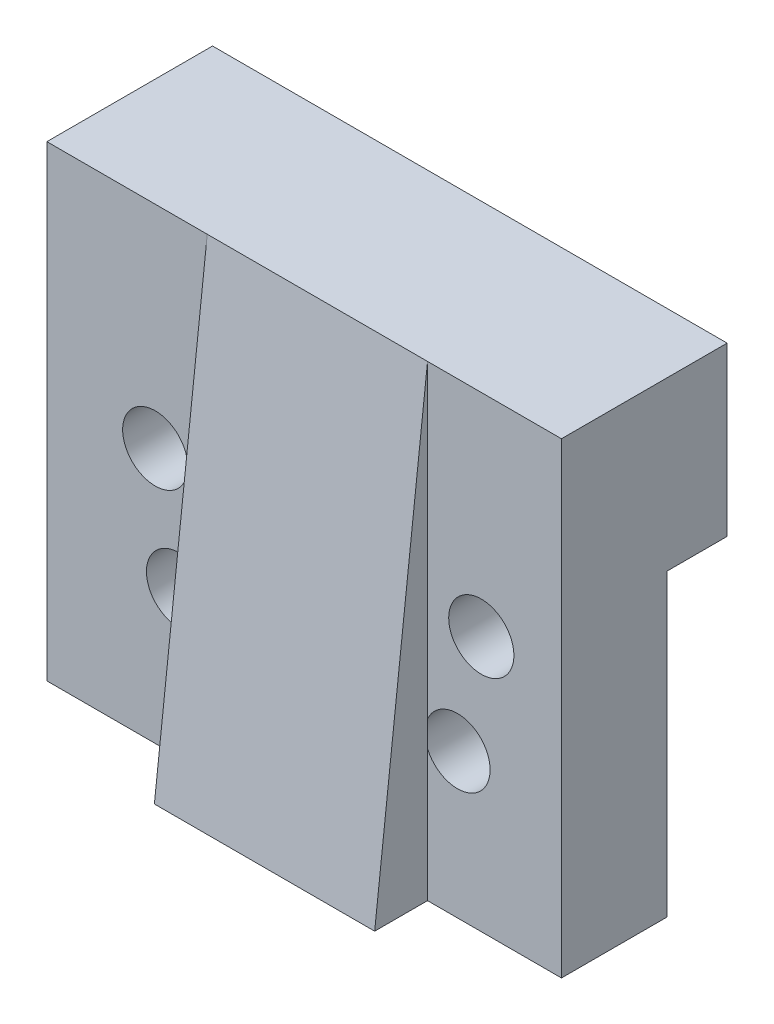
ISO-10303-21;
HEADER;
FILE_DESCRIPTION(('STEP AP214'),'2;1');
FILE_NAME('part.step','',(''),(''),'','','');
FILE_SCHEMA(('AUTOMOTIVE_DESIGN { 1 0 10303 214 1 1 1 1 }'));
ENDSEC;
DATA;
#1=APPLICATION_CONTEXT('core data for automotive mechanical design processes');
#2=APPLICATION_PROTOCOL_DEFINITION('international standard','automotive_design',2000,#1);
#3=PRODUCT_CONTEXT('',#1,'mechanical');
#4=PRODUCT('Part','Part','',(#3));
#5=PRODUCT_RELATED_PRODUCT_CATEGORY('part','',(#4));
#6=PRODUCT_DEFINITION_FORMATION('','',#4);
#7=PRODUCT_DEFINITION_CONTEXT('part definition',#1,'design');
#8=PRODUCT_DEFINITION('design','',#6,#7);
#9=PRODUCT_DEFINITION_SHAPE('','',#8);
#10=(LENGTH_UNIT() NAMED_UNIT(*) SI_UNIT(.MILLI.,.METRE.));
#11=(NAMED_UNIT(*) PLANE_ANGLE_UNIT() SI_UNIT($,.RADIAN.));
#12=(NAMED_UNIT(*) SI_UNIT($,.STERADIAN.) SOLID_ANGLE_UNIT());
#13=UNCERTAINTY_MEASURE_WITH_UNIT(LENGTH_MEASURE(1.E-05),#10,'distance_accuracy_value','');
#14=(GEOMETRIC_REPRESENTATION_CONTEXT(3) GLOBAL_UNCERTAINTY_ASSIGNED_CONTEXT((#13)) GLOBAL_UNIT_ASSIGNED_CONTEXT((#10,
#11,#12)) REPRESENTATION_CONTEXT('',''));
#15=CARTESIAN_POINT('',(0.,0.,0.));
#16=DIRECTION('',(0.,0.,1.));
#17=DIRECTION('',(1.,0.,0.));
#18=AXIS2_PLACEMENT_3D('',#15,#16,#17);
#19=CARTESIAN_POINT('',(0.,0.,6.));
#20=DIRECTION('',(0.,0.,1.));
#21=DIRECTION('',(1.,0.,0.));
#22=AXIS2_PLACEMENT_3D('',#19,#20,#21);
#23=PLANE('',#22);
#24=CARTESIAN_POINT('',(-10.0801094247372,-3.25,6.));
#25=DIRECTION('',(0.,0.,1.));
#26=DIRECTION('',(1.,0.,0.));
#27=AXIS2_PLACEMENT_3D('',#24,#25,#26);
#28=CIRCLE('',#27,1.85);
#29=CARTESIAN_POINT('',(-8.23010942473721,-3.25,6.));
#30=VERTEX_POINT('',#29);
#31=EDGE_CURVE('E277',#30,#30,#28,.T.);
#32=ORIENTED_EDGE('',*,*,#31,.F.);
#33=EDGE_LOOP('',(#32));
#34=FACE_BOUND('',#33,.T.);
#35=DIRECTION('',(1.,0.,0.));
#36=VECTOR('',#35,1.);
#37=CARTESIAN_POINT('',(-16.2301094247372,-17.75,6.));
#38=LINE('',#37,#36);
#39=CARTESIAN_POINT('',(-16.2301094247372,-17.75,6.));
#40=VERTEX_POINT('',#39);
#41=CARTESIAN_POINT('',(-7.13010942473722,-17.75,6.));
#42=VERTEX_POINT('',#41);
#43=EDGE_CURVE('E169',#40,#42,#38,.T.);
#44=ORIENTED_EDGE('',*,*,#43,.T.);
#45=DIRECTION('',(0.,1.,0.));
#46=VECTOR('',#45,1.);
#47=CARTESIAN_POINT('',(-7.13010942473722,-17.75,6.));
#48=LINE('',#47,#46);
#49=CARTESIAN_POINT('',(-7.13010942473722,-10.4787087810503,6.));
#50=VERTEX_POINT('',#49);
#51=EDGE_CURVE('E153',#42,#50,#48,.T.);
#52=ORIENTED_EDGE('',*,*,#51,.T.);
#53=CARTESIAN_POINT('',(-8.73010942473722,-9.55,6.));
#54=DIRECTION('',(0.,0.,1.));
#55=DIRECTION('',(1.,0.,0.));
#56=AXIS2_PLACEMENT_3D('',#53,#54,#55);
#57=CIRCLE('',#56,1.85);
#58=CARTESIAN_POINT('',(-7.13010942473722,-8.62129121894966,6.));
#59=VERTEX_POINT('',#58);
#60=EDGE_CURVE('E272',#59,#50,#57,.T.);
#61=ORIENTED_EDGE('',*,*,#60,.F.);
#62=CARTESIAN_POINT('',(-7.13010942473722,8.75,6.));
#63=VERTEX_POINT('',#62);
#64=EDGE_CURVE('E42',#59,#63,#48,.T.);
#65=ORIENTED_EDGE('',*,*,#64,.T.);
#66=DIRECTION('',(-1.,0.,0.));
#67=VECTOR('',#66,1.);
#68=CARTESIAN_POINT('',(12.9698905752628,8.75,6.));
#69=LINE('',#68,#67);
#70=CARTESIAN_POINT('',(-16.2301094247372,8.75,6.));
#71=VERTEX_POINT('',#70);
#72=EDGE_CURVE('E186',#63,#71,#69,.T.);
#73=ORIENTED_EDGE('',*,*,#72,.T.);
#74=DIRECTION('',(0.,-1.,0.));
#75=VECTOR('',#74,1.);
#76=CARTESIAN_POINT('',(-16.2301094247372,8.75,6.));
#77=LINE('',#76,#75);
#78=EDGE_CURVE('E176',#71,#40,#77,.T.);
#79=ORIENTED_EDGE('',*,*,#78,.T.);
#80=EDGE_LOOP('',(#44,#52,#61,#65,#73,#79));
#81=FACE_BOUND('',#80,.T.);
#82=ADVANCED_FACE('F33',(#34,#81),#23,.T.);
#83=CARTESIAN_POINT('',(0.,0.,0.));
#84=DIRECTION('',(0.,0.,1.));
#85=DIRECTION('',(1.,0.,0.));
#86=AXIS2_PLACEMENT_3D('',#83,#84,#85);
#87=PLANE('',#86);
#88=CARTESIAN_POINT('',(7.06989057526278,-9.55,0.));
#89=DIRECTION('',(0.,0.,1.));
#90=DIRECTION('',(-1.,0.,0.));
#91=AXIS2_PLACEMENT_3D('',#88,#89,#90);
#92=CIRCLE('',#91,1.);
#93=CARTESIAN_POINT('',(6.06989057526278,-9.55,0.));
#94=VERTEX_POINT('',#93);
#95=EDGE_CURVE('E181',#94,#94,#92,.T.);
#96=ORIENTED_EDGE('',*,*,#95,.T.);
#97=EDGE_LOOP('',(#96));
#98=FACE_BOUND('',#97,.T.);
#99=CARTESIAN_POINT('',(8.41989057526278,-3.25,0.));
#100=DIRECTION('',(0.,0.,1.));
#101=DIRECTION('',(-1.,0.,0.));
#102=AXIS2_PLACEMENT_3D('',#99,#100,#101);
#103=CIRCLE('',#102,1.);
#104=CARTESIAN_POINT('',(7.41989057526278,-3.25,0.));
#105=VERTEX_POINT('',#104);
#106=EDGE_CURVE('E203',#105,#105,#103,.T.);
#107=ORIENTED_EDGE('',*,*,#106,.T.);
#108=EDGE_LOOP('',(#107));
#109=FACE_BOUND('',#108,.T.);
#110=CARTESIAN_POINT('',(-10.0801094247372,-3.25,0.));
#111=DIRECTION('',(0.,0.,1.));
#112=DIRECTION('',(1.,0.,0.));
#113=AXIS2_PLACEMENT_3D('',#110,#111,#112);
#114=CIRCLE('',#113,1.);
#115=CARTESIAN_POINT('',(-9.08010942473722,-3.25,0.));
#116=VERTEX_POINT('',#115);
#117=EDGE_CURVE('E209',#116,#116,#114,.T.);
#118=ORIENTED_EDGE('',*,*,#117,.T.);
#119=EDGE_LOOP('',(#118));
#120=FACE_BOUND('',#119,.T.);
#121=CARTESIAN_POINT('',(-8.73010942473722,-9.55,0.));
#122=DIRECTION('',(0.,0.,1.));
#123=DIRECTION('',(1.,0.,0.));
#124=AXIS2_PLACEMENT_3D('',#121,#122,#123);
#125=CIRCLE('',#124,1.);
#126=CARTESIAN_POINT('',(-7.73010942473722,-9.55,0.));
#127=VERTEX_POINT('',#126);
#128=EDGE_CURVE('E197',#127,#127,#125,.T.);
#129=ORIENTED_EDGE('',*,*,#128,.T.);
#130=EDGE_LOOP('',(#129));
#131=FACE_BOUND('',#130,.T.);
#132=DIRECTION('',(-1.,0.,0.));
#133=VECTOR('',#132,1.);
#134=CARTESIAN_POINT('',(12.9698905752628,-0.749999999999994,0.));
#135=LINE('',#134,#133);
#136=CARTESIAN_POINT('',(12.9698905752628,-0.749999999999994,0.));
#137=VERTEX_POINT('',#136);
#138=CARTESIAN_POINT('',(5.36989057526278,-0.749999999999994,0.));
#139=VERTEX_POINT('',#138);
#140=EDGE_CURVE('E227',#137,#139,#135,.T.);
#141=ORIENTED_EDGE('',*,*,#140,.F.);
#142=DIRECTION('',(0.,1.,0.));
#143=VECTOR('',#142,1.);
#144=CARTESIAN_POINT('',(12.9698905752628,8.75,0.));
#145=LINE('',#144,#143);
#146=CARTESIAN_POINT('',(12.9698905752628,-17.75,0.));
#147=VERTEX_POINT('',#146);
#148=EDGE_CURVE('E225',#147,#137,#145,.T.);
#149=ORIENTED_EDGE('',*,*,#148,.F.);
#150=DIRECTION('',(1.,0.,0.));
#151=VECTOR('',#150,1.);
#152=CARTESIAN_POINT('',(-16.2301094247372,-17.75,0.));
#153=LINE('',#152,#151);
#154=CARTESIAN_POINT('',(-16.2301094247372,-17.75,0.));
#155=VERTEX_POINT('',#154);
#156=EDGE_CURVE('E220',#155,#147,#153,.T.);
#157=ORIENTED_EDGE('',*,*,#156,.F.);
#158=DIRECTION('',(0.,-1.,0.));
#159=VECTOR('',#158,1.);
#160=CARTESIAN_POINT('',(-16.2301094247372,-7.,0.));
#161=LINE('',#160,#159);
#162=CARTESIAN_POINT('',(-16.2301094247372,-0.749999999999993,0.));
#163=VERTEX_POINT('',#162);
#164=EDGE_CURVE('E215',#163,#155,#161,.T.);
#165=ORIENTED_EDGE('',*,*,#164,.F.);
#166=DIRECTION('',(-1.,0.,0.));
#167=VECTOR('',#166,1.);
#168=CARTESIAN_POINT('',(-7.03010942473722,-0.749999999999994,0.));
#169=LINE('',#168,#167);
#170=CARTESIAN_POINT('',(-7.03010942473722,-0.749999999999994,0.));
#171=VERTEX_POINT('',#170);
#172=EDGE_CURVE('E58',#171,#163,#169,.T.);
#173=ORIENTED_EDGE('',*,*,#172,.F.);
#174=DIRECTION('',(0.,1.,0.));
#175=VECTOR('',#174,1.);
#176=CARTESIAN_POINT('',(-7.03010942473722,-5.5,0.));
#177=LINE('',#176,#175);
#178=CARTESIAN_POINT('',(-7.03010942473722,-5.5,0.));
#179=VERTEX_POINT('',#178);
#180=EDGE_CURVE('E243',#179,#171,#177,.T.);
#181=ORIENTED_EDGE('',*,*,#180,.F.);
#182=DIRECTION('',(-0.707106781186547,0.707106781186548,0.));
#183=VECTOR('',#182,1.);
#184=CARTESIAN_POINT('',(-5.53010942473722,-7.,0.));
#185=LINE('',#184,#183);
#186=CARTESIAN_POINT('',(-5.53010942473722,-7.,0.));
#187=VERTEX_POINT('',#186);
#188=EDGE_CURVE('E380',#187,#179,#185,.T.);
#189=ORIENTED_EDGE('',*,*,#188,.F.);
#190=DIRECTION('',(-1.,0.,0.));
#191=VECTOR('',#190,1.);
#192=CARTESIAN_POINT('',(3.86989057526278,-7.,0.));
#193=LINE('',#192,#191);
#194=CARTESIAN_POINT('',(3.86989057526278,-7.,0.));
#195=VERTEX_POINT('',#194);
#196=EDGE_CURVE('E378',#195,#187,#193,.T.);
#197=ORIENTED_EDGE('',*,*,#196,.F.);
#198=DIRECTION('',(-0.707106781186547,-0.707106781186548,0.));
#199=VECTOR('',#198,1.);
#200=CARTESIAN_POINT('',(3.86989057526278,-7.,0.));
#201=LINE('',#200,#199);
#202=CARTESIAN_POINT('',(5.36989057526278,-5.5,0.));
#203=VERTEX_POINT('',#202);
#204=EDGE_CURVE('E375',#203,#195,#201,.T.);
#205=ORIENTED_EDGE('',*,*,#204,.F.);
#206=DIRECTION('',(0.,-1.,0.));
#207=VECTOR('',#206,1.);
#208=CARTESIAN_POINT('',(5.36989057526278,-0.749999999999994,0.));
#209=LINE('',#208,#207);
#210=EDGE_CURVE('E230',#139,#203,#209,.T.);
#211=ORIENTED_EDGE('',*,*,#210,.F.);
#212=EDGE_LOOP('',(#141,#149,#157,#165,#173,#181,#189,#197,#205,#211));
#213=FACE_BOUND('',#212,.T.);
#214=ADVANCED_FACE('F410',(#98,#109,#120,#131,#213),#87,.F.);
#215=CARTESIAN_POINT('',(0.,0.,1.7));
#216=DIRECTION('',(0.,0.,1.));
#217=DIRECTION('',(1.,0.,0.));
#218=AXIS2_PLACEMENT_3D('',#215,#216,#217);
#219=PLANE('',#218);
#220=CARTESIAN_POINT('',(-10.0801094247372,-3.25,1.7));
#221=DIRECTION('',(0.,0.,1.));
#222=DIRECTION('',(1.,0.,0.));
#223=AXIS2_PLACEMENT_3D('',#220,#221,#222);
#224=CIRCLE('',#223,1.85);
#225=CARTESIAN_POINT('',(-8.23010942473721,-3.25,1.7));
#226=VERTEX_POINT('',#225);
#227=EDGE_CURVE('E319',#226,#226,#224,.F.);
#228=ORIENTED_EDGE('',*,*,#227,.F.);
#229=EDGE_LOOP('',(#228));
#230=FACE_BOUND('',#229,.T.);
#231=CARTESIAN_POINT('',(-10.0801094247372,-3.25,1.7));
#232=DIRECTION('',(0.,0.,1.));
#233=DIRECTION('',(1.,0.,0.));
#234=AXIS2_PLACEMENT_3D('',#231,#232,#233);
#235=CIRCLE('',#234,1.);
#236=CARTESIAN_POINT('',(-9.08010942473722,-3.25,1.7));
#237=VERTEX_POINT('',#236);
#238=EDGE_CURVE('E212',#237,#237,#235,.T.);
#239=ORIENTED_EDGE('',*,*,#238,.F.);
#240=EDGE_LOOP('',(#239));
#241=FACE_BOUND('',#240,.T.);
#242=ADVANCED_FACE('F417',(#230,#241),#219,.T.);
#243=CARTESIAN_POINT('',(8.41989057526278,-3.25,1.7));
#244=DIRECTION('',(0.,0.,1.));
#245=DIRECTION('',(1.,0.,0.));
#246=AXIS2_PLACEMENT_3D('',#243,#244,#245);
#247=CIRCLE('',#246,1.85);
#248=CARTESIAN_POINT('',(10.2698905752628,-3.25,1.7));
#249=VERTEX_POINT('',#248);
#250=EDGE_CURVE('E317',#249,#249,#247,.F.);
#251=ORIENTED_EDGE('',*,*,#250,.F.);
#252=EDGE_LOOP('',(#251));
#253=FACE_BOUND('',#252,.T.);
#254=CARTESIAN_POINT('',(8.41989057526278,-3.25,1.7));
#255=DIRECTION('',(0.,0.,1.));
#256=DIRECTION('',(-1.,0.,0.));
#257=AXIS2_PLACEMENT_3D('',#254,#255,#256);
#258=CIRCLE('',#257,1.);
#259=CARTESIAN_POINT('',(7.41989057526278,-3.25,1.7));
#260=VERTEX_POINT('',#259);
#261=EDGE_CURVE('E206',#260,#260,#258,.T.);
#262=ORIENTED_EDGE('',*,*,#261,.F.);
#263=EDGE_LOOP('',(#262));
#264=FACE_BOUND('',#263,.T.);
#265=ADVANCED_FACE('F445',(#253,#264),#219,.T.);
#266=CARTESIAN_POINT('',(-8.73010942473722,-9.55,1.7));
#267=DIRECTION('',(0.,0.,1.));
#268=DIRECTION('',(1.,0.,0.));
#269=AXIS2_PLACEMENT_3D('',#266,#267,#268);
#270=CIRCLE('',#269,1.85);
#271=CARTESIAN_POINT('',(-6.88010942473722,-9.55,1.7));
#272=VERTEX_POINT('',#271);
#273=EDGE_CURVE('E314',#272,#272,#270,.F.);
#274=ORIENTED_EDGE('',*,*,#273,.F.);
#275=EDGE_LOOP('',(#274));
#276=FACE_BOUND('',#275,.T.);
#277=CARTESIAN_POINT('',(-8.73010942473722,-9.55,1.7));
#278=DIRECTION('',(0.,0.,1.));
#279=DIRECTION('',(1.,0.,0.));
#280=AXIS2_PLACEMENT_3D('',#277,#278,#279);
#281=CIRCLE('',#280,1.);
#282=CARTESIAN_POINT('',(-7.73010942473722,-9.55,1.7));
#283=VERTEX_POINT('',#282);
#284=EDGE_CURVE('E200',#283,#283,#281,.T.);
#285=ORIENTED_EDGE('',*,*,#284,.F.);
#286=EDGE_LOOP('',(#285));
#287=FACE_BOUND('',#286,.T.);
#288=ADVANCED_FACE('F448',(#276,#287),#219,.T.);
#289=CARTESIAN_POINT('',(7.06989057526278,-9.55,1.7));
#290=DIRECTION('',(0.,0.,1.));
#291=DIRECTION('',(1.,0.,0.));
#292=AXIS2_PLACEMENT_3D('',#289,#290,#291);
#293=CIRCLE('',#292,1.85);
#294=CARTESIAN_POINT('',(8.91989057526279,-9.55,1.7));
#295=VERTEX_POINT('',#294);
#296=EDGE_CURVE('E299',#295,#295,#293,.F.);
#297=ORIENTED_EDGE('',*,*,#296,.F.);
#298=EDGE_LOOP('',(#297));
#299=FACE_BOUND('',#298,.T.);
#300=CARTESIAN_POINT('',(7.06989057526278,-9.55,1.7));
#301=DIRECTION('',(0.,0.,1.));
#302=DIRECTION('',(-1.,0.,0.));
#303=AXIS2_PLACEMENT_3D('',#300,#301,#302);
#304=CIRCLE('',#303,1.);
#305=CARTESIAN_POINT('',(6.06989057526278,-9.55,1.7));
#306=VERTEX_POINT('',#305);
#307=EDGE_CURVE('E194',#306,#306,#304,.T.);
#308=ORIENTED_EDGE('',*,*,#307,.F.);
#309=EDGE_LOOP('',(#308));
#310=FACE_BOUND('',#309,.T.);
#311=ADVANCED_FACE('F504',(#299,#310),#219,.T.);
#312=CARTESIAN_POINT('',(12.9698905752628,8.75,1.7));
#313=DIRECTION('',(0.,-1.,0.));
#314=DIRECTION('',(1.,0.,0.));
#315=AXIS2_PLACEMENT_3D('',#312,#313,#314);
#316=PLANE('',#315);
#317=DIRECTION('',(0.,0.,-1.));
#318=VECTOR('',#317,1.);
#319=CARTESIAN_POINT('',(12.9698905752628,8.75,1.7));
#320=LINE('',#319,#318);
#321=CARTESIAN_POINT('',(12.9698905752628,8.75,6.));
#322=VERTEX_POINT('',#321);
#323=CARTESIAN_POINT('',(12.9698905752628,8.75,-3.4));
#324=VERTEX_POINT('',#323);
#325=EDGE_CURVE('E308',#322,#324,#320,.T.);
#326=ORIENTED_EDGE('',*,*,#325,.T.);
#327=DIRECTION('',(1.,0.,0.));
#328=VECTOR('',#327,1.);
#329=CARTESIAN_POINT('',(-16.2301094247372,8.75,-3.4));
#330=LINE('',#329,#328);
#331=CARTESIAN_POINT('',(-16.2301094247372,8.75,-3.4));
#332=VERTEX_POINT('',#331);
#333=EDGE_CURVE('E295',#332,#324,#330,.T.);
#334=ORIENTED_EDGE('',*,*,#333,.F.);
#335=DIRECTION('',(0.,0.,-1.));
#336=VECTOR('',#335,1.);
#337=CARTESIAN_POINT('',(-16.2301094247372,8.75,1.7));
#338=LINE('',#337,#336);
#339=EDGE_CURVE('E293',#71,#332,#338,.T.);
#340=ORIENTED_EDGE('',*,*,#339,.F.);
#341=ORIENTED_EDGE('',*,*,#72,.F.);
#342=DIRECTION('',(1.,0.,0.));
#343=VECTOR('',#342,1.);
#344=CARTESIAN_POINT('',(-7.13010942473722,8.75,6.));
#345=LINE('',#344,#343);
#346=CARTESIAN_POINT('',(5.36989057526278,8.75,6.));
#347=VERTEX_POINT('',#346);
#348=EDGE_CURVE('E351',#63,#347,#345,.T.);
#349=ORIENTED_EDGE('',*,*,#348,.T.);
#350=EDGE_CURVE('E281',#322,#347,#69,.T.);
#351=ORIENTED_EDGE('',*,*,#350,.F.);
#352=EDGE_LOOP('',(#326,#334,#340,#341,#349,#351));
#353=FACE_BOUND('',#352,.T.);
#354=ADVANCED_FACE('F35',(#353),#316,.F.);
#355=CARTESIAN_POINT('',(-16.2301094247372,-7.,1.7));
#356=DIRECTION('',(1.,0.,0.));
#357=DIRECTION('',(0.,0.,-1.));
#358=AXIS2_PLACEMENT_3D('',#355,#356,#357);
#359=PLANE('',#358);
#360=ORIENTED_EDGE('',*,*,#339,.T.);
#361=DIRECTION('',(0.,1.,0.));
#362=VECTOR('',#361,1.);
#363=CARTESIAN_POINT('',(-16.2301094247372,-0.749999999999992,-3.4));
#364=LINE('',#363,#362);
#365=CARTESIAN_POINT('',(-16.2301094247372,-0.749999999999992,-3.4));
#366=VERTEX_POINT('',#365);
#367=EDGE_CURVE('E369',#366,#332,#364,.T.);
#368=ORIENTED_EDGE('',*,*,#367,.F.);
#369=DIRECTION('',(0.,0.,1.));
#370=VECTOR('',#369,1.);
#371=CARTESIAN_POINT('',(-16.2301094247372,-0.749999999999992,-3.4));
#372=LINE('',#371,#370);
#373=EDGE_CURVE('E236',#366,#163,#372,.T.);
#374=ORIENTED_EDGE('',*,*,#373,.T.);
#375=ORIENTED_EDGE('',*,*,#164,.T.);
#376=DIRECTION('',(0.,0.,-1.));
#377=VECTOR('',#376,1.);
#378=CARTESIAN_POINT('',(-16.2301094247372,-17.75,1.7));
#379=LINE('',#378,#377);
#380=EDGE_CURVE('E300',#40,#155,#379,.T.);
#381=ORIENTED_EDGE('',*,*,#380,.F.);
#382=ORIENTED_EDGE('',*,*,#78,.F.);
#383=EDGE_LOOP('',(#360,#368,#374,#375,#381,#382));
#384=FACE_BOUND('',#383,.T.);
#385=ADVANCED_FACE('F302',(#384),#359,.F.);
#386=CARTESIAN_POINT('',(-16.2301094247372,-17.75,1.7));
#387=DIRECTION('',(0.,1.,0.));
#388=DIRECTION('',(0.,0.,1.));
#389=AXIS2_PLACEMENT_3D('',#386,#387,#388);
#390=PLANE('',#389);
#391=ORIENTED_EDGE('',*,*,#156,.T.);
#392=DIRECTION('',(0.,0.,-1.));
#393=VECTOR('',#392,1.);
#394=CARTESIAN_POINT('',(12.9698905752628,-17.75,1.7));
#395=LINE('',#394,#393);
#396=CARTESIAN_POINT('',(12.9698905752628,-17.75,6.));
#397=VERTEX_POINT('',#396);
#398=EDGE_CURVE('E305',#397,#147,#395,.T.);
#399=ORIENTED_EDGE('',*,*,#398,.F.);
#400=CARTESIAN_POINT('',(5.36989057526278,-17.75,6.));
#401=VERTEX_POINT('',#400);
#402=EDGE_CURVE('E178',#401,#397,#38,.T.);
#403=ORIENTED_EDGE('',*,*,#402,.F.);
#404=DIRECTION('',(0.,0.,-1.));
#405=VECTOR('',#404,1.);
#406=CARTESIAN_POINT('',(5.36989057526278,-17.75,6.));
#407=LINE('',#406,#405);
#408=CARTESIAN_POINT('',(5.36989057526278,-17.75,9.));
#409=VERTEX_POINT('',#408);
#410=EDGE_CURVE('E340',#409,#401,#407,.T.);
#411=ORIENTED_EDGE('',*,*,#410,.F.);
#412=DIRECTION('',(1.,0.,0.));
#413=VECTOR('',#412,1.);
#414=CARTESIAN_POINT('',(-7.13010942473722,-17.75,9.));
#415=LINE('',#414,#413);
#416=CARTESIAN_POINT('',(-7.13010942473722,-17.75,9.));
#417=VERTEX_POINT('',#416);
#418=EDGE_CURVE('E171',#417,#409,#415,.T.);
#419=ORIENTED_EDGE('',*,*,#418,.F.);
#420=DIRECTION('',(0.,0.,-1.));
#421=VECTOR('',#420,1.);
#422=CARTESIAN_POINT('',(-7.13010942473722,-17.75,6.));
#423=LINE('',#422,#421);
#424=EDGE_CURVE('E156',#417,#42,#423,.T.);
#425=ORIENTED_EDGE('',*,*,#424,.T.);
#426=ORIENTED_EDGE('',*,*,#43,.F.);
#427=ORIENTED_EDGE('',*,*,#380,.T.);
#428=EDGE_LOOP('',(#391,#399,#403,#411,#419,#425,#426,#427));
#429=FACE_BOUND('',#428,.T.);
#430=ADVANCED_FACE('F167',(#429),#390,.F.);
#431=CARTESIAN_POINT('',(12.9698905752628,8.75,1.7));
#432=DIRECTION('',(-1.,0.,0.));
#433=DIRECTION('',(0.,0.,1.));
#434=AXIS2_PLACEMENT_3D('',#431,#432,#433);
#435=PLANE('',#434);
#436=ORIENTED_EDGE('',*,*,#148,.T.);
#437=DIRECTION('',(0.,0.,1.));
#438=VECTOR('',#437,1.);
#439=CARTESIAN_POINT('',(12.9698905752628,-0.749999999999994,-3.4));
#440=LINE('',#439,#438);
#441=CARTESIAN_POINT('',(12.9698905752628,-0.749999999999994,-3.4));
#442=VERTEX_POINT('',#441);
#443=EDGE_CURVE('E233',#442,#137,#440,.T.);
#444=ORIENTED_EDGE('',*,*,#443,.F.);
#445=DIRECTION('',(0.,-1.,0.));
#446=VECTOR('',#445,1.);
#447=CARTESIAN_POINT('',(12.9698905752628,8.75,-3.4));
#448=LINE('',#447,#446);
#449=EDGE_CURVE('E237',#324,#442,#448,.T.);
#450=ORIENTED_EDGE('',*,*,#449,.F.);
#451=ORIENTED_EDGE('',*,*,#325,.F.);
#452=DIRECTION('',(0.,1.,0.));
#453=VECTOR('',#452,1.);
#454=CARTESIAN_POINT('',(12.9698905752628,-7.,6.));
#455=LINE('',#454,#453);
#456=EDGE_CURVE('E177',#397,#322,#455,.T.);
#457=ORIENTED_EDGE('',*,*,#456,.F.);
#458=ORIENTED_EDGE('',*,*,#398,.T.);
#459=EDGE_LOOP('',(#436,#444,#450,#451,#457,#458));
#460=FACE_BOUND('',#459,.T.);
#461=ADVANCED_FACE('F468',(#460),#435,.F.);
#462=CARTESIAN_POINT('',(-10.0801094247372,-3.25,1.7));
#463=DIRECTION('',(0.,0.,-1.));
#464=DIRECTION('',(-1.,0.,0.));
#465=AXIS2_PLACEMENT_3D('',#462,#463,#464);
#466=CYLINDRICAL_SURFACE('',#465,1.);
#467=ORIENTED_EDGE('',*,*,#238,.T.);
#468=EDGE_LOOP('',(#467));
#469=FACE_BOUND('',#468,.T.);
#470=ORIENTED_EDGE('',*,*,#117,.F.);
#471=EDGE_LOOP('',(#470));
#472=FACE_BOUND('',#471,.T.);
#473=ADVANCED_FACE('F455',(#469,#472),#466,.F.);
#474=CARTESIAN_POINT('',(8.41989057526278,-3.25,1.7));
#475=DIRECTION('',(0.,0.,-1.));
#476=DIRECTION('',(-1.,0.,0.));
#477=AXIS2_PLACEMENT_3D('',#474,#475,#476);
#478=CYLINDRICAL_SURFACE('',#477,1.);
#479=ORIENTED_EDGE('',*,*,#261,.T.);
#480=EDGE_LOOP('',(#479));
#481=FACE_BOUND('',#480,.T.);
#482=ORIENTED_EDGE('',*,*,#106,.F.);
#483=EDGE_LOOP('',(#482));
#484=FACE_BOUND('',#483,.T.);
#485=ADVANCED_FACE('F452',(#481,#484),#478,.F.);
#486=CARTESIAN_POINT('',(-8.73010942473722,-9.55,1.7));
#487=DIRECTION('',(0.,0.,-1.));
#488=DIRECTION('',(-1.,0.,0.));
#489=AXIS2_PLACEMENT_3D('',#486,#487,#488);
#490=CYLINDRICAL_SURFACE('',#489,1.);
#491=ORIENTED_EDGE('',*,*,#284,.T.);
#492=EDGE_LOOP('',(#491));
#493=FACE_BOUND('',#492,.T.);
#494=ORIENTED_EDGE('',*,*,#128,.F.);
#495=EDGE_LOOP('',(#494));
#496=FACE_BOUND('',#495,.T.);
#497=ADVANCED_FACE('F432',(#493,#496),#490,.F.);
#498=CARTESIAN_POINT('',(7.06989057526278,-9.55,1.7));
#499=DIRECTION('',(0.,0.,-1.));
#500=DIRECTION('',(-1.,0.,0.));
#501=AXIS2_PLACEMENT_3D('',#498,#499,#500);
#502=CYLINDRICAL_SURFACE('',#501,1.);
#503=ORIENTED_EDGE('',*,*,#307,.T.);
#504=EDGE_LOOP('',(#503));
#505=FACE_BOUND('',#504,.T.);
#506=ORIENTED_EDGE('',*,*,#95,.F.);
#507=EDGE_LOOP('',(#506));
#508=FACE_BOUND('',#507,.T.);
#509=ADVANCED_FACE('F425',(#505,#508),#502,.F.);
#510=DIRECTION('',(0.,1.,0.));
#511=VECTOR('',#510,1.);
#512=CARTESIAN_POINT('',(5.36989057526278,-17.75,6.));
#513=LINE('',#512,#511);
#514=CARTESIAN_POINT('',(5.36989057526278,-10.2797259759663,6.));
#515=VERTEX_POINT('',#514);
#516=EDGE_CURVE('E337',#401,#515,#513,.T.);
#517=ORIENTED_EDGE('',*,*,#516,.F.);
#518=ORIENTED_EDGE('',*,*,#402,.T.);
#519=ORIENTED_EDGE('',*,*,#456,.T.);
#520=ORIENTED_EDGE('',*,*,#350,.T.);
#521=CARTESIAN_POINT('',(5.36989057526278,-8.82027402403368,6.));
#522=VERTEX_POINT('',#521);
#523=EDGE_CURVE('E11',#522,#347,#513,.T.);
#524=ORIENTED_EDGE('',*,*,#523,.F.);
#525=CARTESIAN_POINT('',(7.06989057526278,-9.55,6.));
#526=DIRECTION('',(0.,0.,1.));
#527=DIRECTION('',(-1.,0.,0.));
#528=AXIS2_PLACEMENT_3D('',#525,#526,#527);
#529=CIRCLE('',#528,1.85);
#530=EDGE_CURVE('E268',#515,#522,#529,.T.);
#531=ORIENTED_EDGE('',*,*,#530,.F.);
#532=EDGE_LOOP('',(#517,#518,#519,#520,#524,#531));
#533=FACE_BOUND('',#532,.T.);
#534=CARTESIAN_POINT('',(8.41989057526278,-3.25,6.));
#535=DIRECTION('',(0.,0.,1.));
#536=DIRECTION('',(-1.,0.,0.));
#537=AXIS2_PLACEMENT_3D('',#534,#535,#536);
#538=CIRCLE('',#537,1.85);
#539=CARTESIAN_POINT('',(6.56989057526278,-3.25,6.));
#540=VERTEX_POINT('',#539);
#541=EDGE_CURVE('E274',#540,#540,#538,.T.);
#542=ORIENTED_EDGE('',*,*,#541,.F.);
#543=EDGE_LOOP('',(#542));
#544=FACE_BOUND('',#543,.T.);
#545=ADVANCED_FACE('F413',(#533,#544),#23,.T.);
#546=CARTESIAN_POINT('',(-10.0801094247372,-3.25,6.));
#547=DIRECTION('',(0.,0.,-1.));
#548=DIRECTION('',(-1.,0.,0.));
#549=AXIS2_PLACEMENT_3D('',#546,#547,#548);
#550=CYLINDRICAL_SURFACE('',#549,1.85);
#551=ORIENTED_EDGE('',*,*,#31,.T.);
#552=EDGE_LOOP('',(#551));
#553=FACE_BOUND('',#552,.T.);
#554=ORIENTED_EDGE('',*,*,#227,.T.);
#555=EDGE_LOOP('',(#554));
#556=FACE_BOUND('',#555,.T.);
#557=ADVANCED_FACE('F424',(#553,#556),#550,.F.);
#558=CARTESIAN_POINT('',(8.41989057526278,-3.25,6.));
#559=DIRECTION('',(0.,0.,-1.));
#560=DIRECTION('',(-1.,0.,0.));
#561=AXIS2_PLACEMENT_3D('',#558,#559,#560);
#562=CYLINDRICAL_SURFACE('',#561,1.85);
#563=ORIENTED_EDGE('',*,*,#541,.T.);
#564=EDGE_LOOP('',(#563));
#565=FACE_BOUND('',#564,.T.);
#566=ORIENTED_EDGE('',*,*,#250,.T.);
#567=EDGE_LOOP('',(#566));
#568=FACE_BOUND('',#567,.T.);
#569=ADVANCED_FACE('F430',(#565,#568),#562,.F.);
#570=CARTESIAN_POINT('',(-8.73010942473722,-9.55,6.));
#571=DIRECTION('',(0.,0.,-1.));
#572=DIRECTION('',(-1.,0.,0.));
#573=AXIS2_PLACEMENT_3D('',#570,#571,#572);
#574=CYLINDRICAL_SURFACE('',#573,1.85);
#575=ORIENTED_EDGE('',*,*,#60,.T.);
#576=EDGE_CURVE('E271',#50,#59,#57,.T.);
#577=ORIENTED_EDGE('',*,*,#576,.T.);
#578=EDGE_LOOP('',(#575,#577));
#579=FACE_BOUND('',#578,.T.);
#580=ORIENTED_EDGE('',*,*,#273,.T.);
#581=EDGE_LOOP('',(#580));
#582=FACE_BOUND('',#581,.T.);
#583=ADVANCED_FACE('F441',(#579,#582),#574,.F.);
#584=CARTESIAN_POINT('',(7.06989057526278,-9.55,6.));
#585=DIRECTION('',(0.,0.,-1.));
#586=DIRECTION('',(-1.,0.,0.));
#587=AXIS2_PLACEMENT_3D('',#584,#585,#586);
#588=CYLINDRICAL_SURFACE('',#587,1.85);
#589=ORIENTED_EDGE('',*,*,#530,.T.);
#590=EDGE_CURVE('E267',#522,#515,#529,.T.);
#591=ORIENTED_EDGE('',*,*,#590,.T.);
#592=EDGE_LOOP('',(#589,#591));
#593=FACE_BOUND('',#592,.T.);
#594=ORIENTED_EDGE('',*,*,#296,.T.);
#595=EDGE_LOOP('',(#594));
#596=FACE_BOUND('',#595,.T.);
#597=ADVANCED_FACE('F490',(#593,#596),#588,.F.);
#598=CARTESIAN_POINT('',(12.9698905752628,-0.749999999999994,-3.4));
#599=DIRECTION('',(0.,1.,0.));
#600=DIRECTION('',(0.,0.,1.));
#601=AXIS2_PLACEMENT_3D('',#598,#599,#600);
#602=PLANE('',#601);
#603=ORIENTED_EDGE('',*,*,#140,.T.);
#604=DIRECTION('',(0.,0.,1.));
#605=VECTOR('',#604,1.);
#606=CARTESIAN_POINT('',(5.36989057526278,-0.749999999999994,-3.4));
#607=LINE('',#606,#605);
#608=CARTESIAN_POINT('',(5.36989057526278,-0.749999999999994,-3.4));
#609=VERTEX_POINT('',#608);
#610=EDGE_CURVE('E264',#609,#139,#607,.T.);
#611=ORIENTED_EDGE('',*,*,#610,.F.);
#612=DIRECTION('',(-1.,0.,0.));
#613=VECTOR('',#612,1.);
#614=CARTESIAN_POINT('',(12.9698905752628,-0.749999999999994,-3.4));
#615=LINE('',#614,#613);
#616=EDGE_CURVE('E242',#442,#609,#615,.T.);
#617=ORIENTED_EDGE('',*,*,#616,.F.);
#618=ORIENTED_EDGE('',*,*,#443,.T.);
#619=EDGE_LOOP('',(#603,#611,#617,#618));
#620=FACE_BOUND('',#619,.T.);
#621=ADVANCED_FACE('F473',(#620),#602,.F.);
#622=CARTESIAN_POINT('',(5.36989057526278,-0.749999999999994,-3.4));
#623=DIRECTION('',(-1.,0.,0.));
#624=DIRECTION('',(0.,-1.,0.));
#625=AXIS2_PLACEMENT_3D('',#622,#623,#624);
#626=PLANE('',#625);
#627=ORIENTED_EDGE('',*,*,#210,.T.);
#628=DIRECTION('',(0.,0.,1.));
#629=VECTOR('',#628,1.);
#630=CARTESIAN_POINT('',(5.36989057526278,-5.5,-3.4));
#631=LINE('',#630,#629);
#632=CARTESIAN_POINT('',(5.36989057526278,-5.5,-3.4));
#633=VERTEX_POINT('',#632);
#634=EDGE_CURVE('E261',#633,#203,#631,.T.);
#635=ORIENTED_EDGE('',*,*,#634,.F.);
#636=DIRECTION('',(0.,-1.,0.));
#637=VECTOR('',#636,1.);
#638=CARTESIAN_POINT('',(5.36989057526278,-0.749999999999994,-3.4));
#639=LINE('',#638,#637);
#640=EDGE_CURVE('E357',#609,#633,#639,.T.);
#641=ORIENTED_EDGE('',*,*,#640,.F.);
#642=ORIENTED_EDGE('',*,*,#610,.T.);
#643=EDGE_LOOP('',(#627,#635,#641,#642));
#644=FACE_BOUND('',#643,.T.);
#645=ADVANCED_FACE('F479',(#644),#626,.F.);
#646=CARTESIAN_POINT('',(3.86989057526278,-7.,-3.4));
#647=DIRECTION('',(-0.707106781186548,0.707106781186547,0.));
#648=DIRECTION('',(-0.707106781186547,-0.707106781186548,0.));
#649=AXIS2_PLACEMENT_3D('',#646,#647,#648);
#650=PLANE('',#649);
#651=ORIENTED_EDGE('',*,*,#204,.T.);
#652=DIRECTION('',(0.,0.,1.));
#653=VECTOR('',#652,1.);
#654=CARTESIAN_POINT('',(3.86989057526278,-7.,-3.4));
#655=LINE('',#654,#653);
#656=CARTESIAN_POINT('',(3.86989057526278,-7.,-3.4));
#657=VERTEX_POINT('',#656);
#658=EDGE_CURVE('E258',#657,#195,#655,.T.);
#659=ORIENTED_EDGE('',*,*,#658,.F.);
#660=DIRECTION('',(-0.707106781186547,-0.707106781186548,0.));
#661=VECTOR('',#660,1.);
#662=CARTESIAN_POINT('',(3.86989057526278,-7.,-3.4));
#663=LINE('',#662,#661);
#664=EDGE_CURVE('E359',#633,#657,#663,.T.);
#665=ORIENTED_EDGE('',*,*,#664,.F.);
#666=ORIENTED_EDGE('',*,*,#634,.T.);
#667=EDGE_LOOP('',(#651,#659,#665,#666));
#668=FACE_BOUND('',#667,.T.);
#669=ADVANCED_FACE('F406',(#668),#650,.F.);
#670=CARTESIAN_POINT('',(3.86989057526278,-7.,-3.4));
#671=DIRECTION('',(0.,1.,0.));
#672=DIRECTION('',(0.,0.,1.));
#673=AXIS2_PLACEMENT_3D('',#670,#671,#672);
#674=PLANE('',#673);
#675=ORIENTED_EDGE('',*,*,#196,.T.);
#676=DIRECTION('',(0.,0.,1.));
#677=VECTOR('',#676,1.);
#678=CARTESIAN_POINT('',(-5.53010942473722,-7.,-3.4));
#679=LINE('',#678,#677);
#680=CARTESIAN_POINT('',(-5.53010942473722,-7.,-3.4));
#681=VERTEX_POINT('',#680);
#682=EDGE_CURVE('E255',#681,#187,#679,.T.);
#683=ORIENTED_EDGE('',*,*,#682,.F.);
#684=DIRECTION('',(-1.,0.,0.));
#685=VECTOR('',#684,1.);
#686=CARTESIAN_POINT('',(3.86989057526278,-7.,-3.4));
#687=LINE('',#686,#685);
#688=EDGE_CURVE('E361',#657,#681,#687,.T.);
#689=ORIENTED_EDGE('',*,*,#688,.F.);
#690=ORIENTED_EDGE('',*,*,#658,.T.);
#691=EDGE_LOOP('',(#675,#683,#689,#690));
#692=FACE_BOUND('',#691,.T.);
#693=ADVANCED_FACE('F399',(#692),#674,.F.);
#694=CARTESIAN_POINT('',(-5.53010942473722,-7.,-3.4));
#695=DIRECTION('',(0.707106781186548,0.707106781186547,0.));
#696=DIRECTION('',(-0.707106781186547,0.707106781186548,0.));
#697=AXIS2_PLACEMENT_3D('',#694,#695,#696);
#698=PLANE('',#697);
#699=ORIENTED_EDGE('',*,*,#188,.T.);
#700=DIRECTION('',(0.,0.,1.));
#701=VECTOR('',#700,1.);
#702=CARTESIAN_POINT('',(-7.03010942473722,-5.5,-3.4));
#703=LINE('',#702,#701);
#704=CARTESIAN_POINT('',(-7.03010942473722,-5.5,-3.4));
#705=VERTEX_POINT('',#704);
#706=EDGE_CURVE('E252',#705,#179,#703,.T.);
#707=ORIENTED_EDGE('',*,*,#706,.F.);
#708=DIRECTION('',(-0.707106781186547,0.707106781186548,0.));
#709=VECTOR('',#708,1.);
#710=CARTESIAN_POINT('',(-5.53010942473722,-7.,-3.4));
#711=LINE('',#710,#709);
#712=EDGE_CURVE('E363',#681,#705,#711,.T.);
#713=ORIENTED_EDGE('',*,*,#712,.F.);
#714=ORIENTED_EDGE('',*,*,#682,.T.);
#715=EDGE_LOOP('',(#699,#707,#713,#714));
#716=FACE_BOUND('',#715,.T.);
#717=ADVANCED_FACE('F397',(#716),#698,.F.);
#718=CARTESIAN_POINT('',(-7.03010942473722,-5.5,-3.4));
#719=DIRECTION('',(1.,0.,0.));
#720=DIRECTION('',(0.,0.,-1.));
#721=AXIS2_PLACEMENT_3D('',#718,#719,#720);
#722=PLANE('',#721);
#723=ORIENTED_EDGE('',*,*,#180,.T.);
#724=DIRECTION('',(0.,0.,1.));
#725=VECTOR('',#724,1.);
#726=CARTESIAN_POINT('',(-7.03010942473722,-0.749999999999994,-3.4));
#727=LINE('',#726,#725);
#728=CARTESIAN_POINT('',(-7.03010942473722,-0.749999999999994,-3.4));
#729=VERTEX_POINT('',#728);
#730=EDGE_CURVE('E249',#729,#171,#727,.T.);
#731=ORIENTED_EDGE('',*,*,#730,.F.);
#732=DIRECTION('',(0.,1.,0.));
#733=VECTOR('',#732,1.);
#734=CARTESIAN_POINT('',(-7.03010942473722,-5.5,-3.4));
#735=LINE('',#734,#733);
#736=EDGE_CURVE('E365',#705,#729,#735,.T.);
#737=ORIENTED_EDGE('',*,*,#736,.F.);
#738=ORIENTED_EDGE('',*,*,#706,.T.);
#739=EDGE_LOOP('',(#723,#731,#737,#738));
#740=FACE_BOUND('',#739,.T.);
#741=ADVANCED_FACE('F386',(#740),#722,.F.);
#742=CARTESIAN_POINT('',(-7.03010942473722,-0.749999999999994,-3.4));
#743=DIRECTION('',(0.,1.,0.));
#744=DIRECTION('',(-1.,0.,0.));
#745=AXIS2_PLACEMENT_3D('',#742,#743,#744);
#746=PLANE('',#745);
#747=ORIENTED_EDGE('',*,*,#172,.T.);
#748=ORIENTED_EDGE('',*,*,#373,.F.);
#749=DIRECTION('',(-1.,0.,0.));
#750=VECTOR('',#749,1.);
#751=CARTESIAN_POINT('',(-7.03010942473722,-0.749999999999994,-3.4));
#752=LINE('',#751,#750);
#753=EDGE_CURVE('E367',#729,#366,#752,.T.);
#754=ORIENTED_EDGE('',*,*,#753,.F.);
#755=ORIENTED_EDGE('',*,*,#730,.T.);
#756=EDGE_LOOP('',(#747,#748,#754,#755));
#757=FACE_BOUND('',#756,.T.);
#758=ADVANCED_FACE('F390',(#757),#746,.F.);
#759=CARTESIAN_POINT('',(0.,0.,-3.4));
#760=DIRECTION('',(0.,0.,1.));
#761=DIRECTION('',(1.,0.,0.));
#762=AXIS2_PLACEMENT_3D('',#759,#760,#761);
#763=PLANE('',#762);
#764=ORIENTED_EDGE('',*,*,#616,.T.);
#765=ORIENTED_EDGE('',*,*,#640,.T.);
#766=ORIENTED_EDGE('',*,*,#664,.T.);
#767=ORIENTED_EDGE('',*,*,#688,.T.);
#768=ORIENTED_EDGE('',*,*,#712,.T.);
#769=ORIENTED_EDGE('',*,*,#736,.T.);
#770=ORIENTED_EDGE('',*,*,#753,.T.);
#771=ORIENTED_EDGE('',*,*,#367,.T.);
#772=ORIENTED_EDGE('',*,*,#333,.T.);
#773=ORIENTED_EDGE('',*,*,#449,.T.);
#774=EDGE_LOOP('',(#764,#765,#766,#767,#768,#769,#770,#771,#772,#773));
#775=FACE_BOUND('',#774,.T.);
#776=ADVANCED_FACE('F393',(#775),#763,.F.);
#777=CARTESIAN_POINT('',(-7.13010942473722,-17.75,6.));
#778=DIRECTION('',(0.,0.,-1.));
#779=DIRECTION('',(-1.,0.,0.));
#780=AXIS2_PLACEMENT_3D('',#777,#778,#779);
#781=PLANE('',#780);
#782=ORIENTED_EDGE('',*,*,#576,.F.);
#783=EDGE_CURVE('E158',#50,#59,#48,.T.);
#784=ORIENTED_EDGE('',*,*,#783,.T.);
#785=EDGE_LOOP('',(#782,#784));
#786=FACE_BOUND('',#785,.T.);
#787=ADVANCED_FACE('F616',(#786),#781,.T.);
#788=ORIENTED_EDGE('',*,*,#590,.F.);
#789=EDGE_CURVE('E327',#515,#522,#513,.T.);
#790=ORIENTED_EDGE('',*,*,#789,.F.);
#791=EDGE_LOOP('',(#788,#790));
#792=FACE_BOUND('',#791,.T.);
#793=ADVANCED_FACE('F640',(#792),#781,.T.);
#794=CARTESIAN_POINT('',(-7.13010942473722,-17.75,9.));
#795=DIRECTION('',(0.,0.112489015280939,0.993652968314957));
#796=DIRECTION('',(0.,-0.993652968314957,0.112489015280939));
#797=AXIS2_PLACEMENT_3D('',#794,#795,#796);
#798=PLANE('',#797);
#799=DIRECTION('',(0.,-0.993652968314957,0.112489015280939));
#800=VECTOR('',#799,1.);
#801=CARTESIAN_POINT('',(5.36989057526278,-17.75,9.));
#802=LINE('',#801,#800);
#803=EDGE_CURVE('E172',#347,#409,#802,.T.);
#804=ORIENTED_EDGE('',*,*,#803,.F.);
#805=ORIENTED_EDGE('',*,*,#348,.F.);
#806=DIRECTION('',(0.,-0.993652968314957,0.112489015280939));
#807=VECTOR('',#806,1.);
#808=CARTESIAN_POINT('',(-7.13010942473722,-17.75,9.));
#809=LINE('',#808,#807);
#810=EDGE_CURVE('E50',#63,#417,#809,.T.);
#811=ORIENTED_EDGE('',*,*,#810,.T.);
#812=ORIENTED_EDGE('',*,*,#418,.T.);
#813=EDGE_LOOP('',(#804,#805,#811,#812));
#814=FACE_BOUND('',#813,.T.);
#815=ADVANCED_FACE('F350',(#814),#798,.T.);
#816=CARTESIAN_POINT('',(-7.13010942473722,0.,0.));
#817=DIRECTION('',(-1.,0.,0.));
#818=DIRECTION('',(0.,0.,1.));
#819=AXIS2_PLACEMENT_3D('',#816,#817,#818);
#820=PLANE('',#819);
#821=ORIENTED_EDGE('',*,*,#424,.F.);
#822=ORIENTED_EDGE('',*,*,#810,.F.);
#823=ORIENTED_EDGE('',*,*,#64,.F.);
#824=ORIENTED_EDGE('',*,*,#783,.F.);
#825=ORIENTED_EDGE('',*,*,#51,.F.);
#826=EDGE_LOOP('',(#821,#822,#823,#824,#825));
#827=FACE_BOUND('',#826,.T.);
#828=ADVANCED_FACE('F155',(#827),#820,.T.);
#829=CARTESIAN_POINT('',(5.36989057526278,0.,0.));
#830=DIRECTION('',(-1.,0.,0.));
#831=DIRECTION('',(0.,0.,1.));
#832=AXIS2_PLACEMENT_3D('',#829,#830,#831);
#833=PLANE('',#832);
#834=ORIENTED_EDGE('',*,*,#410,.T.);
#835=ORIENTED_EDGE('',*,*,#516,.T.);
#836=ORIENTED_EDGE('',*,*,#789,.T.);
#837=ORIENTED_EDGE('',*,*,#523,.T.);
#838=ORIENTED_EDGE('',*,*,#803,.T.);
#839=EDGE_LOOP('',(#834,#835,#836,#837,#838));
#840=FACE_BOUND('',#839,.T.);
#841=ADVANCED_FACE('F346',(#840),#833,.F.);
#842=CLOSED_SHELL('',(#82,#214,#242,#265,#288,#311,#354,#385,#430,#461,#473,#485,#497,#509,#545,
#557,#569,#583,#597,#621,#645,#669,#693,#717,#741,#758,#776,#787,#793,#815,#828,#841));
#843=MANIFOLD_SOLID_BREP('B2',#842);
#844=ADVANCED_BREP_SHAPE_REPRESENTATION('',(#18,#843),#14);
#845=SHAPE_DEFINITION_REPRESENTATION(#9,#844);
ENDSEC;
END-ISO-10303-21;
